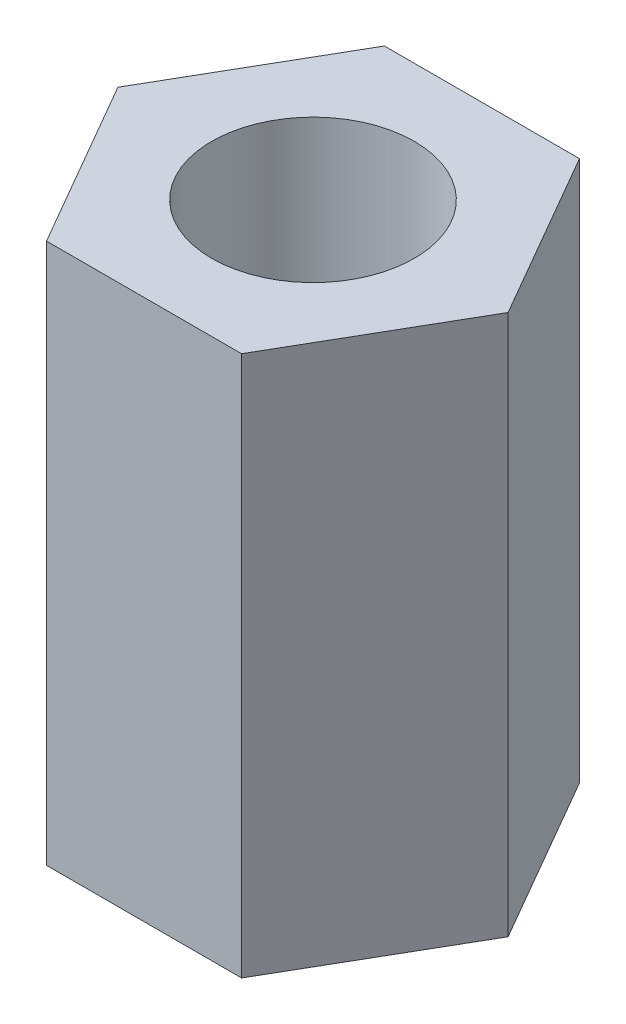
ISO-10303-21;
HEADER;
FILE_DESCRIPTION(('STEP AP214'),'2;1');
FILE_NAME('part.step','',(''),(''),'','','');
FILE_SCHEMA(('AUTOMOTIVE_DESIGN { 1 0 10303 214 1 1 1 1 }'));
ENDSEC;
DATA;
#1=APPLICATION_CONTEXT('core data for automotive mechanical design processes');
#2=APPLICATION_PROTOCOL_DEFINITION('international standard','automotive_design',2000,#1);
#3=PRODUCT_CONTEXT('',#1,'mechanical');
#4=PRODUCT('Part','Part','',(#3));
#5=PRODUCT_RELATED_PRODUCT_CATEGORY('part','',(#4));
#6=PRODUCT_DEFINITION_FORMATION('','',#4);
#7=PRODUCT_DEFINITION_CONTEXT('part definition',#1,'design');
#8=PRODUCT_DEFINITION('design','',#6,#7);
#9=PRODUCT_DEFINITION_SHAPE('','',#8);
#10=(LENGTH_UNIT() NAMED_UNIT(*) SI_UNIT(.MILLI.,.METRE.));
#11=(NAMED_UNIT(*) PLANE_ANGLE_UNIT() SI_UNIT($,.RADIAN.));
#12=(NAMED_UNIT(*) SI_UNIT($,.STERADIAN.) SOLID_ANGLE_UNIT());
#13=UNCERTAINTY_MEASURE_WITH_UNIT(LENGTH_MEASURE(1.E-05),#10,'distance_accuracy_value','');
#14=(GEOMETRIC_REPRESENTATION_CONTEXT(3) GLOBAL_UNCERTAINTY_ASSIGNED_CONTEXT((#13)) GLOBAL_UNIT_ASSIGNED_CONTEXT((#10,
#11,#12)) REPRESENTATION_CONTEXT('',''));
#15=CARTESIAN_POINT('',(0.,0.,0.));
#16=DIRECTION('',(0.,0.,1.));
#17=DIRECTION('',(1.,0.,0.));
#18=AXIS2_PLACEMENT_3D('',#15,#16,#17);
#19=CARTESIAN_POINT('',(0.,4.,0.));
#20=DIRECTION('',(0.,1.,0.));
#21=DIRECTION('',(0.,0.,1.));
#22=AXIS2_PLACEMENT_3D('',#19,#20,#21);
#23=PLANE('',#22);
#24=DIRECTION('',(1.,0.,0.));
#25=VECTOR('',#24,1.);
#26=CARTESIAN_POINT('',(-1.44337567297405,4.,2.5));
#27=LINE('',#26,#25);
#28=CARTESIAN_POINT('',(-1.44337567297405,4.,2.5));
#29=VERTEX_POINT('',#28);
#30=CARTESIAN_POINT('',(1.44337567297408,4.,2.5));
#31=VERTEX_POINT('',#30);
#32=EDGE_CURVE('E129',#29,#31,#27,.T.);
#33=ORIENTED_EDGE('',*,*,#32,.T.);
#34=DIRECTION('',(0.500000000000001,0.,-0.866025403784438));
#35=VECTOR('',#34,1.);
#36=CARTESIAN_POINT('',(1.44337567297408,4.,2.5));
#37=LINE('',#36,#35);
#38=CARTESIAN_POINT('',(2.88675134594815,4.,0.));
#39=VERTEX_POINT('',#38);
#40=EDGE_CURVE('E87',#31,#39,#37,.T.);
#41=ORIENTED_EDGE('',*,*,#40,.T.);
#42=DIRECTION('',(-0.500000000000001,0.,-0.866025403784438));
#43=VECTOR('',#42,1.);
#44=CARTESIAN_POINT('',(2.88675134594815,4.,0.));
#45=LINE('',#44,#43);
#46=CARTESIAN_POINT('',(1.44337567297408,4.,-2.50000000000001));
#47=VERTEX_POINT('',#46);
#48=EDGE_CURVE('E100',#39,#47,#45,.T.);
#49=ORIENTED_EDGE('',*,*,#48,.T.);
#50=DIRECTION('',(-1.,0.,0.));
#51=VECTOR('',#50,1.);
#52=CARTESIAN_POINT('',(1.44337567297408,4.,-2.50000000000001));
#53=LINE('',#52,#51);
#54=CARTESIAN_POINT('',(-1.44337567297405,4.,-2.50000000000001));
#55=VERTEX_POINT('',#54);
#56=EDGE_CURVE('E94',#47,#55,#53,.T.);
#57=ORIENTED_EDGE('',*,*,#56,.T.);
#58=DIRECTION('',(-0.5,0.,0.866025403784438));
#59=VECTOR('',#58,1.);
#60=CARTESIAN_POINT('',(-1.44337567297405,4.,-2.50000000000001));
#61=LINE('',#60,#59);
#62=CARTESIAN_POINT('',(-2.88675134594812,4.,0.));
#63=VERTEX_POINT('',#62);
#64=EDGE_CURVE('E98',#55,#63,#61,.T.);
#65=ORIENTED_EDGE('',*,*,#64,.T.);
#66=DIRECTION('',(0.5,0.,0.866025403784438));
#67=VECTOR('',#66,1.);
#68=CARTESIAN_POINT('',(-2.88675134594812,4.,0.));
#69=LINE('',#68,#67);
#70=EDGE_CURVE('E50',#63,#29,#69,.T.);
#71=ORIENTED_EDGE('',*,*,#70,.T.);
#72=EDGE_LOOP('',(#33,#41,#49,#57,#65,#71));
#73=FACE_BOUND('',#72,.T.);
#74=CARTESIAN_POINT('',(0.,4.,0.));
#75=DIRECTION('',(0.,1.,0.));
#76=DIRECTION('',(0.,0.,1.));
#77=AXIS2_PLACEMENT_3D('',#74,#75,#76);
#78=CIRCLE('',#77,1.5);
#79=CARTESIAN_POINT('',(0.,4.,1.5));
#80=VERTEX_POINT('',#79);
#81=EDGE_CURVE('E122',#80,#80,#78,.T.);
#82=ORIENTED_EDGE('',*,*,#81,.F.);
#83=EDGE_LOOP('',(#82));
#84=FACE_BOUND('',#83,.T.);
#85=ADVANCED_FACE('F33',(#73,#84),#23,.T.);
#86=CARTESIAN_POINT('',(0.,-4.,0.));
#87=DIRECTION('',(0.,1.,0.));
#88=DIRECTION('',(0.,0.,1.));
#89=AXIS2_PLACEMENT_3D('',#86,#87,#88);
#90=PLANE('',#89);
#91=DIRECTION('',(1.,0.,0.));
#92=VECTOR('',#91,1.);
#93=CARTESIAN_POINT('',(-1.44337567297405,-4.,2.5));
#94=LINE('',#93,#92);
#95=CARTESIAN_POINT('',(-1.44337567297405,-4.,2.5));
#96=VERTEX_POINT('',#95);
#97=CARTESIAN_POINT('',(1.44337567297408,-4.,2.5));
#98=VERTEX_POINT('',#97);
#99=EDGE_CURVE('E118',#96,#98,#94,.T.);
#100=ORIENTED_EDGE('',*,*,#99,.F.);
#101=DIRECTION('',(0.5,0.,0.866025403784438));
#102=VECTOR('',#101,1.);
#103=CARTESIAN_POINT('',(-2.88675134594812,-4.,0.));
#104=LINE('',#103,#102);
#105=CARTESIAN_POINT('',(-2.88675134594812,-4.,0.));
#106=VERTEX_POINT('',#105);
#107=EDGE_CURVE('E79',#106,#96,#104,.T.);
#108=ORIENTED_EDGE('',*,*,#107,.F.);
#109=DIRECTION('',(-0.5,0.,0.866025403784438));
#110=VECTOR('',#109,1.);
#111=CARTESIAN_POINT('',(-1.44337567297405,-4.,-2.50000000000001));
#112=LINE('',#111,#110);
#113=CARTESIAN_POINT('',(-1.44337567297405,-4.,-2.50000000000001));
#114=VERTEX_POINT('',#113);
#115=EDGE_CURVE('E73',#114,#106,#112,.T.);
#116=ORIENTED_EDGE('',*,*,#115,.F.);
#117=DIRECTION('',(-1.,0.,0.));
#118=VECTOR('',#117,1.);
#119=CARTESIAN_POINT('',(1.44337567297408,-4.,-2.50000000000001));
#120=LINE('',#119,#118);
#121=CARTESIAN_POINT('',(1.44337567297408,-4.,-2.50000000000001));
#122=VERTEX_POINT('',#121);
#123=EDGE_CURVE('E108',#122,#114,#120,.T.);
#124=ORIENTED_EDGE('',*,*,#123,.F.);
#125=DIRECTION('',(-0.500000000000001,0.,-0.866025403784438));
#126=VECTOR('',#125,1.);
#127=CARTESIAN_POINT('',(2.88675134594815,-4.,0.));
#128=LINE('',#127,#126);
#129=CARTESIAN_POINT('',(2.88675134594815,-4.,0.));
#130=VERTEX_POINT('',#129);
#131=EDGE_CURVE('E124',#130,#122,#128,.T.);
#132=ORIENTED_EDGE('',*,*,#131,.F.);
#133=DIRECTION('',(0.500000000000001,0.,-0.866025403784438));
#134=VECTOR('',#133,1.);
#135=CARTESIAN_POINT('',(1.44337567297408,-4.,2.5));
#136=LINE('',#135,#134);
#137=EDGE_CURVE('E121',#98,#130,#136,.T.);
#138=ORIENTED_EDGE('',*,*,#137,.F.);
#139=EDGE_LOOP('',(#100,#108,#116,#124,#132,#138));
#140=FACE_BOUND('',#139,.T.);
#141=CARTESIAN_POINT('',(0.,-4.,0.));
#142=DIRECTION('',(0.,1.,0.));
#143=DIRECTION('',(0.,0.,1.));
#144=AXIS2_PLACEMENT_3D('',#141,#142,#143);
#145=CIRCLE('',#144,1.5);
#146=CARTESIAN_POINT('',(0.,-4.,1.5));
#147=VERTEX_POINT('',#146);
#148=EDGE_CURVE('E222',#147,#147,#145,.T.);
#149=ORIENTED_EDGE('',*,*,#148,.T.);
#150=EDGE_LOOP('',(#149));
#151=FACE_BOUND('',#150,.T.);
#152=ADVANCED_FACE('F138',(#140,#151),#90,.F.);
#153=CARTESIAN_POINT('',(-1.44337567297405,4.,2.5));
#154=DIRECTION('',(0.,0.,-1.));
#155=DIRECTION('',(-1.,0.,0.));
#156=AXIS2_PLACEMENT_3D('',#153,#154,#155);
#157=PLANE('',#156);
#158=ORIENTED_EDGE('',*,*,#99,.T.);
#159=DIRECTION('',(0.,-1.,0.));
#160=VECTOR('',#159,1.);
#161=CARTESIAN_POINT('',(1.44337567297408,4.,2.5));
#162=LINE('',#161,#160);
#163=EDGE_CURVE('E11',#31,#98,#162,.T.);
#164=ORIENTED_EDGE('',*,*,#163,.F.);
#165=ORIENTED_EDGE('',*,*,#32,.F.);
#166=DIRECTION('',(0.,-1.,0.));
#167=VECTOR('',#166,1.);
#168=CARTESIAN_POINT('',(-1.44337567297405,4.,2.5));
#169=LINE('',#168,#167);
#170=EDGE_CURVE('E114',#29,#96,#169,.T.);
#171=ORIENTED_EDGE('',*,*,#170,.T.);
#172=EDGE_LOOP('',(#158,#164,#165,#171));
#173=FACE_BOUND('',#172,.T.);
#174=ADVANCED_FACE('F35',(#173),#157,.F.);
#175=CARTESIAN_POINT('',(1.44337567297408,4.,2.5));
#176=DIRECTION('',(-0.866025403784438,0.,-0.500000000000001));
#177=DIRECTION('',(-0.500000000000001,0.,0.866025403784438));
#178=AXIS2_PLACEMENT_3D('',#175,#176,#177);
#179=PLANE('',#178);
#180=ORIENTED_EDGE('',*,*,#137,.T.);
#181=DIRECTION('',(0.,-1.,0.));
#182=VECTOR('',#181,1.);
#183=CARTESIAN_POINT('',(2.88675134594815,4.,0.));
#184=LINE('',#183,#182);
#185=EDGE_CURVE('E42',#39,#130,#184,.T.);
#186=ORIENTED_EDGE('',*,*,#185,.F.);
#187=ORIENTED_EDGE('',*,*,#40,.F.);
#188=ORIENTED_EDGE('',*,*,#163,.T.);
#189=EDGE_LOOP('',(#180,#186,#187,#188));
#190=FACE_BOUND('',#189,.T.);
#191=ADVANCED_FACE('F163',(#190),#179,.F.);
#192=CARTESIAN_POINT('',(2.88675134594815,4.,0.));
#193=DIRECTION('',(-0.866025403784438,0.,0.500000000000001));
#194=DIRECTION('',(0.500000000000001,0.,0.866025403784438));
#195=AXIS2_PLACEMENT_3D('',#192,#193,#194);
#196=PLANE('',#195);
#197=ORIENTED_EDGE('',*,*,#131,.T.);
#198=DIRECTION('',(0.,-1.,0.));
#199=VECTOR('',#198,1.);
#200=CARTESIAN_POINT('',(1.44337567297408,4.,-2.50000000000001));
#201=LINE('',#200,#199);
#202=EDGE_CURVE('E109',#47,#122,#201,.T.);
#203=ORIENTED_EDGE('',*,*,#202,.F.);
#204=ORIENTED_EDGE('',*,*,#48,.F.);
#205=ORIENTED_EDGE('',*,*,#185,.T.);
#206=EDGE_LOOP('',(#197,#203,#204,#205));
#207=FACE_BOUND('',#206,.T.);
#208=ADVANCED_FACE('F135',(#207),#196,.F.);
#209=CARTESIAN_POINT('',(1.44337567297408,4.,-2.50000000000001));
#210=DIRECTION('',(0.,0.,1.));
#211=DIRECTION('',(1.,0.,0.));
#212=AXIS2_PLACEMENT_3D('',#209,#210,#211);
#213=PLANE('',#212);
#214=ORIENTED_EDGE('',*,*,#123,.T.);
#215=DIRECTION('',(0.,-1.,0.));
#216=VECTOR('',#215,1.);
#217=CARTESIAN_POINT('',(-1.44337567297405,4.,-2.50000000000001));
#218=LINE('',#217,#216);
#219=EDGE_CURVE('E105',#55,#114,#218,.T.);
#220=ORIENTED_EDGE('',*,*,#219,.F.);
#221=ORIENTED_EDGE('',*,*,#56,.F.);
#222=ORIENTED_EDGE('',*,*,#202,.T.);
#223=EDGE_LOOP('',(#214,#220,#221,#222));
#224=FACE_BOUND('',#223,.T.);
#225=ADVANCED_FACE('F106',(#224),#213,.F.);
#226=CARTESIAN_POINT('',(-1.44337567297405,4.,-2.50000000000001));
#227=DIRECTION('',(0.866025403784439,0.,0.5));
#228=DIRECTION('',(0.5,0.,-0.866025403784439));
#229=AXIS2_PLACEMENT_3D('',#226,#227,#228);
#230=PLANE('',#229);
#231=ORIENTED_EDGE('',*,*,#115,.T.);
#232=DIRECTION('',(0.,-1.,0.));
#233=VECTOR('',#232,1.);
#234=CARTESIAN_POINT('',(-2.88675134594812,4.,0.));
#235=LINE('',#234,#233);
#236=EDGE_CURVE('E110',#63,#106,#235,.T.);
#237=ORIENTED_EDGE('',*,*,#236,.F.);
#238=ORIENTED_EDGE('',*,*,#64,.F.);
#239=ORIENTED_EDGE('',*,*,#219,.T.);
#240=EDGE_LOOP('',(#231,#237,#238,#239));
#241=FACE_BOUND('',#240,.T.);
#242=ADVANCED_FACE('F112',(#241),#230,.F.);
#243=CARTESIAN_POINT('',(-2.88675134594812,4.,0.));
#244=DIRECTION('',(0.866025403784438,0.,-0.5));
#245=DIRECTION('',(-0.5,0.,-0.866025403784438));
#246=AXIS2_PLACEMENT_3D('',#243,#244,#245);
#247=PLANE('',#246);
#248=ORIENTED_EDGE('',*,*,#107,.T.);
#249=ORIENTED_EDGE('',*,*,#170,.F.);
#250=ORIENTED_EDGE('',*,*,#70,.F.);
#251=ORIENTED_EDGE('',*,*,#236,.T.);
#252=EDGE_LOOP('',(#248,#249,#250,#251));
#253=FACE_BOUND('',#252,.T.);
#254=ADVANCED_FACE('F143',(#253),#247,.F.);
#255=CARTESIAN_POINT('',(0.,4.,0.));
#256=DIRECTION('',(0.,-1.,0.));
#257=DIRECTION('',(0.,0.,-1.));
#258=AXIS2_PLACEMENT_3D('',#255,#256,#257);
#259=CYLINDRICAL_SURFACE('',#258,1.5);
#260=ORIENTED_EDGE('',*,*,#81,.T.);
#261=EDGE_LOOP('',(#260));
#262=FACE_BOUND('',#261,.T.);
#263=ORIENTED_EDGE('',*,*,#148,.F.);
#264=EDGE_LOOP('',(#263));
#265=FACE_BOUND('',#264,.T.);
#266=ADVANCED_FACE('F145',(#262,#265),#259,.F.);
#267=CLOSED_SHELL('',(#85,#152,#174,#191,#208,#225,#242,#254,#266));
#268=MANIFOLD_SOLID_BREP('B2',#267);
#269=ADVANCED_BREP_SHAPE_REPRESENTATION('',(#18,#268),#14);
#270=SHAPE_DEFINITION_REPRESENTATION(#9,#269);
ENDSEC;
END-ISO-10303-21;
